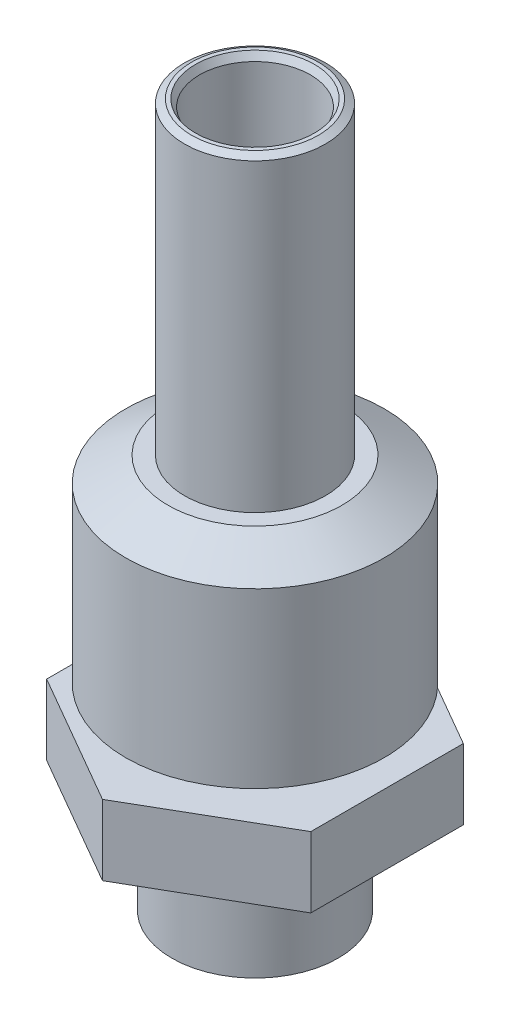
ISO-10303-21;
HEADER;
FILE_DESCRIPTION(('STEP AP214'),'2;1');
FILE_NAME('part.step','',(''),(''),'','','');
FILE_SCHEMA(('AUTOMOTIVE_DESIGN { 1 0 10303 214 1 1 1 1 }'));
ENDSEC;
DATA;
#1=APPLICATION_CONTEXT('core data for automotive mechanical design processes');
#2=APPLICATION_PROTOCOL_DEFINITION('international standard','automotive_design',2000,#1);
#3=PRODUCT_CONTEXT('',#1,'mechanical');
#4=PRODUCT('Part','Part','',(#3));
#5=PRODUCT_RELATED_PRODUCT_CATEGORY('part','',(#4));
#6=PRODUCT_DEFINITION_FORMATION('','',#4);
#7=PRODUCT_DEFINITION_CONTEXT('part definition',#1,'design');
#8=PRODUCT_DEFINITION('design','',#6,#7);
#9=PRODUCT_DEFINITION_SHAPE('','',#8);
#10=(LENGTH_UNIT() NAMED_UNIT(*) SI_UNIT(.MILLI.,.METRE.));
#11=(NAMED_UNIT(*) PLANE_ANGLE_UNIT() SI_UNIT($,.RADIAN.));
#12=(NAMED_UNIT(*) SI_UNIT($,.STERADIAN.) SOLID_ANGLE_UNIT());
#13=UNCERTAINTY_MEASURE_WITH_UNIT(LENGTH_MEASURE(1.E-05),#10,'distance_accuracy_value','');
#14=(GEOMETRIC_REPRESENTATION_CONTEXT(3) GLOBAL_UNCERTAINTY_ASSIGNED_CONTEXT((#13)) GLOBAL_UNIT_ASSIGNED_CONTEXT((#10,
#11,#12)) REPRESENTATION_CONTEXT('',''));
#15=CARTESIAN_POINT('',(0.,0.,0.));
#16=DIRECTION('',(0.,0.,1.));
#17=DIRECTION('',(1.,0.,0.));
#18=AXIS2_PLACEMENT_3D('',#15,#16,#17);
#19=CARTESIAN_POINT('',(4.7625,27.432,2.74963065701559));
#20=DIRECTION('',(-1.,0.,0.));
#21=DIRECTION('',(0.,0.,1.));
#22=AXIS2_PLACEMENT_3D('',#19,#20,#21);
#23=PLANE('',#22);
#24=DIRECTION('',(0.,0.,1.));
#25=VECTOR('',#24,1.);
#26=CARTESIAN_POINT('',(4.7625,5.762,2.74963065701559));
#27=LINE('',#26,#25);
#28=CARTESIAN_POINT('',(4.7625,5.762,-2.74963065701559));
#29=VERTEX_POINT('',#28);
#30=CARTESIAN_POINT('',(4.7625,5.762,2.74963065701559));
#31=VERTEX_POINT('',#30);
#32=EDGE_CURVE('E64',#29,#31,#27,.T.);
#33=ORIENTED_EDGE('',*,*,#32,.F.);
#34=DIRECTION('',(0.,-1.,0.));
#35=VECTOR('',#34,1.);
#36=CARTESIAN_POINT('',(4.7625,27.432,-2.74963065701559));
#37=LINE('',#36,#35);
#38=CARTESIAN_POINT('',(4.7625,8.302,-2.74963065701559));
#39=VERTEX_POINT('',#38);
#40=EDGE_CURVE('E145',#39,#29,#37,.T.);
#41=ORIENTED_EDGE('',*,*,#40,.F.);
#42=DIRECTION('',(0.,0.,1.));
#43=VECTOR('',#42,1.);
#44=CARTESIAN_POINT('',(4.7625,8.302,2.74963065701559));
#45=LINE('',#44,#43);
#46=CARTESIAN_POINT('',(4.7625,8.302,2.74963065701559));
#47=VERTEX_POINT('',#46);
#48=EDGE_CURVE('E134',#39,#47,#45,.T.);
#49=ORIENTED_EDGE('',*,*,#48,.T.);
#50=DIRECTION('',(0.,-1.,0.));
#51=VECTOR('',#50,1.);
#52=CARTESIAN_POINT('',(4.7625,27.432,2.74963065701559));
#53=LINE('',#52,#51);
#54=EDGE_CURVE('E128',#47,#31,#53,.T.);
#55=ORIENTED_EDGE('',*,*,#54,.T.);
#56=EDGE_LOOP('',(#33,#41,#49,#55));
#57=FACE_BOUND('',#56,.T.);
#58=ADVANCED_FACE('F49',(#57),#23,.F.);
#59=CARTESIAN_POINT('',(4.7625,27.432,-2.74963065701559));
#60=DIRECTION('',(-0.5,0.,0.866025403784439));
#61=DIRECTION('',(0.866025403784439,0.,0.5));
#62=AXIS2_PLACEMENT_3D('',#59,#60,#61);
#63=PLANE('',#62);
#64=DIRECTION('',(0.866025403784439,0.,0.5));
#65=VECTOR('',#64,1.);
#66=CARTESIAN_POINT('',(4.76249999999999,5.762,-2.7496306570156));
#67=LINE('',#66,#65);
#68=CARTESIAN_POINT('',(0.,5.762,-5.49926131403118));
#69=VERTEX_POINT('',#68);
#70=EDGE_CURVE('E261',#69,#29,#67,.T.);
#71=ORIENTED_EDGE('',*,*,#70,.F.);
#72=DIRECTION('',(0.,-1.,0.));
#73=VECTOR('',#72,1.);
#74=CARTESIAN_POINT('',(0.,27.432,-5.49926131403118));
#75=LINE('',#74,#73);
#76=CARTESIAN_POINT('',(0.,8.302,-5.49926131403118));
#77=VERTEX_POINT('',#76);
#78=EDGE_CURVE('E141',#77,#69,#75,.T.);
#79=ORIENTED_EDGE('',*,*,#78,.F.);
#80=DIRECTION('',(0.866025403784439,0.,0.5));
#81=VECTOR('',#80,1.);
#82=CARTESIAN_POINT('',(4.7625,8.302,-2.74963065701559));
#83=LINE('',#82,#81);
#84=EDGE_CURVE('E252',#77,#39,#83,.T.);
#85=ORIENTED_EDGE('',*,*,#84,.T.);
#86=ORIENTED_EDGE('',*,*,#40,.T.);
#87=EDGE_LOOP('',(#71,#79,#85,#86));
#88=FACE_BOUND('',#87,.T.);
#89=ADVANCED_FACE('F192',(#88),#63,.F.);
#90=CARTESIAN_POINT('',(0.,27.432,-5.49926131403118));
#91=DIRECTION('',(0.500000000000001,0.,0.866025403784438));
#92=DIRECTION('',(0.866025403784438,0.,-0.500000000000001));
#93=AXIS2_PLACEMENT_3D('',#90,#91,#92);
#94=PLANE('',#93);
#95=DIRECTION('',(0.866025403784438,0.,-0.500000000000001));
#96=VECTOR('',#95,1.);
#97=CARTESIAN_POINT('',(0.,5.762,-5.49926131403118));
#98=LINE('',#97,#96);
#99=CARTESIAN_POINT('',(-4.7625,5.762,-2.74963065701559));
#100=VERTEX_POINT('',#99);
#101=EDGE_CURVE('E265',#100,#69,#98,.T.);
#102=ORIENTED_EDGE('',*,*,#101,.F.);
#103=DIRECTION('',(0.,-1.,0.));
#104=VECTOR('',#103,1.);
#105=CARTESIAN_POINT('',(-4.7625,27.432,-2.74963065701559));
#106=LINE('',#105,#104);
#107=CARTESIAN_POINT('',(-4.7625,8.302,-2.74963065701559));
#108=VERTEX_POINT('',#107);
#109=EDGE_CURVE('E131',#108,#100,#106,.T.);
#110=ORIENTED_EDGE('',*,*,#109,.F.);
#111=DIRECTION('',(0.866025403784438,0.,-0.500000000000001));
#112=VECTOR('',#111,1.);
#113=CARTESIAN_POINT('',(0.,8.302,-5.49926131403118));
#114=LINE('',#113,#112);
#115=EDGE_CURVE('E248',#108,#77,#114,.T.);
#116=ORIENTED_EDGE('',*,*,#115,.T.);
#117=ORIENTED_EDGE('',*,*,#78,.T.);
#118=EDGE_LOOP('',(#102,#110,#116,#117));
#119=FACE_BOUND('',#118,.T.);
#120=ADVANCED_FACE('F198',(#119),#94,.F.);
#121=CARTESIAN_POINT('',(-4.7625,27.432,-2.74963065701559));
#122=DIRECTION('',(1.,0.,0.));
#123=DIRECTION('',(0.,0.,-1.));
#124=AXIS2_PLACEMENT_3D('',#121,#122,#123);
#125=PLANE('',#124);
#126=DIRECTION('',(0.,0.,-1.));
#127=VECTOR('',#126,1.);
#128=CARTESIAN_POINT('',(-4.7625,5.762,-2.74963065701559));
#129=LINE('',#128,#127);
#130=CARTESIAN_POINT('',(-4.7625,5.762,2.7496306570156));
#131=VERTEX_POINT('',#130);
#132=EDGE_CURVE('E122',#131,#100,#129,.T.);
#133=ORIENTED_EDGE('',*,*,#132,.F.);
#134=DIRECTION('',(0.,-1.,0.));
#135=VECTOR('',#134,1.);
#136=CARTESIAN_POINT('',(-4.7625,27.432,2.7496306570156));
#137=LINE('',#136,#135);
#138=CARTESIAN_POINT('',(-4.7625,8.302,2.7496306570156));
#139=VERTEX_POINT('',#138);
#140=EDGE_CURVE('E120',#139,#131,#137,.T.);
#141=ORIENTED_EDGE('',*,*,#140,.F.);
#142=DIRECTION('',(0.,0.,-1.));
#143=VECTOR('',#142,1.);
#144=CARTESIAN_POINT('',(-4.7625,8.302,-2.74963065701559));
#145=LINE('',#144,#143);
#146=EDGE_CURVE('E244',#139,#108,#145,.T.);
#147=ORIENTED_EDGE('',*,*,#146,.T.);
#148=ORIENTED_EDGE('',*,*,#109,.T.);
#149=EDGE_LOOP('',(#133,#141,#147,#148));
#150=FACE_BOUND('',#149,.T.);
#151=ADVANCED_FACE('F267',(#150),#125,.F.);
#152=CARTESIAN_POINT('',(-4.7625,27.432,2.7496306570156));
#153=DIRECTION('',(0.5,0.,-0.866025403784439));
#154=DIRECTION('',(-0.866025403784439,0.,-0.5));
#155=AXIS2_PLACEMENT_3D('',#152,#153,#154);
#156=PLANE('',#155);
#157=DIRECTION('',(-0.866025403784439,0.,-0.5));
#158=VECTOR('',#157,1.);
#159=CARTESIAN_POINT('',(-4.7625,5.762,2.74963065701559));
#160=LINE('',#159,#158);
#161=CARTESIAN_POINT('',(0.,5.762,5.49926131403119));
#162=VERTEX_POINT('',#161);
#163=EDGE_CURVE('E108',#162,#131,#160,.T.);
#164=ORIENTED_EDGE('',*,*,#163,.F.);
#165=DIRECTION('',(0.,-1.,0.));
#166=VECTOR('',#165,1.);
#167=CARTESIAN_POINT('',(0.,27.432,5.49926131403119));
#168=LINE('',#167,#166);
#169=CARTESIAN_POINT('',(0.,8.302,5.49926131403119));
#170=VERTEX_POINT('',#169);
#171=EDGE_CURVE('E118',#170,#162,#168,.T.);
#172=ORIENTED_EDGE('',*,*,#171,.F.);
#173=DIRECTION('',(-0.866025403784439,0.,-0.5));
#174=VECTOR('',#173,1.);
#175=CARTESIAN_POINT('',(-4.7625,8.302,2.7496306570156));
#176=LINE('',#175,#174);
#177=EDGE_CURVE('E72',#170,#139,#176,.T.);
#178=ORIENTED_EDGE('',*,*,#177,.T.);
#179=ORIENTED_EDGE('',*,*,#140,.T.);
#180=EDGE_LOOP('',(#164,#172,#178,#179));
#181=FACE_BOUND('',#180,.T.);
#182=ADVANCED_FACE('F117',(#181),#156,.F.);
#183=CARTESIAN_POINT('',(0.,27.432,5.49926131403119));
#184=DIRECTION('',(-0.5,0.,-0.866025403784438));
#185=DIRECTION('',(-0.866025403784438,0.,0.5));
#186=AXIS2_PLACEMENT_3D('',#183,#184,#185);
#187=PLANE('',#186);
#188=DIRECTION('',(-0.866025403784438,0.,0.5));
#189=VECTOR('',#188,1.);
#190=CARTESIAN_POINT('',(0.,5.762,5.49926131403119));
#191=LINE('',#190,#189);
#192=EDGE_CURVE('E12',#31,#162,#191,.T.);
#193=ORIENTED_EDGE('',*,*,#192,.F.);
#194=ORIENTED_EDGE('',*,*,#54,.F.);
#195=DIRECTION('',(-0.866025403784438,0.,0.5));
#196=VECTOR('',#195,1.);
#197=CARTESIAN_POINT('',(0.,8.302,5.49926131403119));
#198=LINE('',#197,#196);
#199=EDGE_CURVE('E126',#47,#170,#198,.T.);
#200=ORIENTED_EDGE('',*,*,#199,.T.);
#201=ORIENTED_EDGE('',*,*,#171,.T.);
#202=EDGE_LOOP('',(#193,#194,#200,#201));
#203=FACE_BOUND('',#202,.T.);
#204=ADVANCED_FACE('F125',(#203),#187,.F.);
#205=CARTESIAN_POINT('',(0.,1.39107264208463,0.));
#206=DIRECTION('',(0.,1.,0.));
#207=DIRECTION('',(0.,0.,1.));
#208=AXIS2_PLACEMENT_3D('',#205,#206,#207);
#209=CONICAL_SURFACE('',#208,0.,1.08210413623648);
#210=CARTESIAN_POINT('',(0.,1.92116035997955,0.));
#211=DIRECTION('',(0.,-1.,0.));
#212=DIRECTION('',(0.,0.,-1.));
#213=AXIS2_PLACEMENT_3D('',#210,#211,#212);
#214=CIRCLE('',#213,0.996949999999998);
#215=CARTESIAN_POINT('',(0.,1.92116035997955,0.996949999999998));
#216=VERTEX_POINT('',#215);
#217=EDGE_CURVE('E277',#216,#216,#214,.T.);
#218=CARTESIAN_POINT('',(0.,1.524,0.));
#219=DIRECTION('',(0.,-1.,0.));
#220=DIRECTION('',(1.,0.,0.));
#221=AXIS2_PLACEMENT_3D('',#218,#219,#220);
#222=CIRCLE('',#221,0.25);
#223=CARTESIAN_POINT('',(0.,1.524,0.249999999999995));
#224=VERTEX_POINT('',#223);
#225=EDGE_CURVE('E351',#224,#224,#222,.T.);
#226=CARTESIAN_POINT('',(0.,1.92116035997955,0.996949999999998));
#227=CARTESIAN_POINT('',(0.,1.91702327289643,0.989169270833332));
#228=CARTESIAN_POINT('',(0.,1.91288618581331,0.981388541666665));
#229=CARTESIAN_POINT('',(0.,1.90461201164707,0.965827083333331));
#230=CARTESIAN_POINT('',(0.,1.90047492456395,0.958046354166665));
#231=CARTESIAN_POINT('',(0.,1.89220075039771,0.942484895833331));
#232=CARTESIAN_POINT('',(0.,1.88806366331458,0.934704166666665));
#233=CARTESIAN_POINT('',(0.,1.87978948914834,0.919142708333331));
#234=CARTESIAN_POINT('',(0.,1.87565240206522,0.911361979166665));
#235=CARTESIAN_POINT('',(0.,1.86737822789898,0.895800520833331));
#236=CARTESIAN_POINT('',(0.,1.86324114081586,0.888019791666664));
#237=CARTESIAN_POINT('',(0.,1.85496696664962,0.872458333333331));
#238=CARTESIAN_POINT('',(0.,1.8508298795665,0.864677604166664));
#239=CARTESIAN_POINT('',(0.,1.84255570540026,0.849116145833331));
#240=CARTESIAN_POINT('',(0.,1.83841861831714,0.841335416666664));
#241=CARTESIAN_POINT('',(0.,1.8301444441509,0.825773958333331));
#242=CARTESIAN_POINT('',(0.,1.82600735706778,0.817993229166664));
#243=CARTESIAN_POINT('',(0.,1.81773318290154,0.802431770833331));
#244=CARTESIAN_POINT('',(0.,1.81359609581842,0.794651041666664));
#245=CARTESIAN_POINT('',(0.,1.80532192165218,0.779089583333331));
#246=CARTESIAN_POINT('',(0.,1.80118483456906,0.771308854166664));
#247=CARTESIAN_POINT('',(0.,1.79291066040282,0.755747395833331));
#248=CARTESIAN_POINT('',(0.,1.7887735733197,0.747966666666664));
#249=CARTESIAN_POINT('',(0.,1.78049939915346,0.732405208333331));
#250=CARTESIAN_POINT('',(0.,1.77636231207034,0.724624479166664));
#251=CARTESIAN_POINT('',(0.,1.7680881379041,0.70906302083333));
#252=CARTESIAN_POINT('',(0.,1.76395105082098,0.701282291666664));
#253=CARTESIAN_POINT('',(0.,1.75567687665474,0.68572083333333));
#254=CARTESIAN_POINT('',(0.,1.75153978957162,0.677940104166664));
#255=CARTESIAN_POINT('',(0.,1.74326561540537,0.66237864583333));
#256=CARTESIAN_POINT('',(0.,1.73912852832225,0.654597916666664));
#257=CARTESIAN_POINT('',(0.,1.73085435415601,0.63903645833333));
#258=CARTESIAN_POINT('',(0.,1.72671726707289,0.631255729166663));
#259=CARTESIAN_POINT('',(0.,1.71844309290665,0.61569427083333));
#260=CARTESIAN_POINT('',(0.,1.71430600582353,0.607913541666663));
#261=CARTESIAN_POINT('',(0.,1.70603183165729,0.59235208333333));
#262=CARTESIAN_POINT('',(0.,1.70189474457417,0.584571354166663));
#263=CARTESIAN_POINT('',(0.,1.69362057040793,0.56900989583333));
#264=CARTESIAN_POINT('',(0.,1.68948348332481,0.561229166666663));
#265=CARTESIAN_POINT('',(0.,1.68120930915857,0.54566770833333));
#266=CARTESIAN_POINT('',(0.,1.67707222207545,0.537886979166663));
#267=CARTESIAN_POINT('',(0.,1.66879804790921,0.52232552083333));
#268=CARTESIAN_POINT('',(0.,1.66466096082609,0.514544791666663));
#269=CARTESIAN_POINT('',(0.,1.65638678665985,0.49898333333333));
#270=CARTESIAN_POINT('',(0.,1.65224969957673,0.491202604166663));
#271=CARTESIAN_POINT('',(0.,1.64397552541049,0.475641145833329));
#272=CARTESIAN_POINT('',(0.,1.63983843832737,0.467860416666663));
#273=CARTESIAN_POINT('',(0.,1.63156426416113,0.452298958333329));
#274=CARTESIAN_POINT('',(0.,1.62742717707801,0.444518229166663));
#275=CARTESIAN_POINT('',(0.,1.61915300291177,0.428956770833329));
#276=CARTESIAN_POINT('',(0.,1.61501591582865,0.421176041666663));
#277=CARTESIAN_POINT('',(0.,1.60674174166241,0.405614583333329));
#278=CARTESIAN_POINT('',(0.,1.60260465457929,0.397833854166662));
#279=CARTESIAN_POINT('',(0.,1.59433048041304,0.382272395833329));
#280=CARTESIAN_POINT('',(0.,1.59019339332992,0.374491666666662));
#281=CARTESIAN_POINT('',(0.,1.58191921916368,0.358930208333329));
#282=CARTESIAN_POINT('',(0.,1.57778213208056,0.351149479166662));
#283=CARTESIAN_POINT('',(0.,1.56950795791432,0.335588020833329));
#284=CARTESIAN_POINT('',(0.,1.5653708708312,0.327807291666662));
#285=CARTESIAN_POINT('',(0.,1.55709669666496,0.312245833333329));
#286=CARTESIAN_POINT('',(0.,1.55295960958184,0.304465104166662));
#287=CARTESIAN_POINT('',(0.,1.5446854354156,0.288903645833329));
#288=CARTESIAN_POINT('',(0.,1.54054834833248,0.281122916666662));
#289=CARTESIAN_POINT('',(0.,1.53227417416624,0.265561458333329));
#290=CARTESIAN_POINT('',(0.,1.52813708708312,0.257780729166662));
#291=CARTESIAN_POINT('',(0.,1.524,0.249999999999995));
#292=B_SPLINE_CURVE_WITH_KNOTS('',3,(#226,#227,#228,#229,#230,#231,#232,#233,#234,#235,#236,
#237,#238,#239,#240,#241,#242,#243,#244,#245,#246,#247,#248,#249,#250,#251,#252,#253,#254,#255,
#256,#257,#258,#259,#260,#261,#262,#263,#264,#265,#266,#267,#268,#269,#270,#271,#272,#273,#274,
#275,#276,#277,#278,#279,#280,#281,#282,#283,#284,#285,#286,#287,#288,#289,#290,#291),
.UNSPECIFIED.,.F.,.F.,(4,2,2,2,2,2,2,2,2,2,2,2,2,2,2,2,2,2,2,2,2,2,2,2,2,2,2,2,2,2,2,2,4),(0.,
0.0264366624800681,0.0528733249601363,0.0793099874402046,0.105746649920273,0.132183312400341,
0.158619974880409,0.185056637360477,0.211493299840546,0.237929962320614,0.264366624800682,
0.29080328728075,0.317239949760819,0.343676612240887,0.370113274720955,0.396549937201023,
0.422986599681091,0.44942326216116,0.475859924641228,0.502296587121296,0.528733249601364,
0.555169912081433,0.581606574561501,0.608043237041569,0.634479899521637,0.660916562001706,
0.687353224481774,0.713789886961842,0.74022654944191,0.766663211921978,0.793099874402047,
0.819536536882115,0.845973199362183),.UNSPECIFIED.);
#293=EDGE_CURVE('BSEAM307',#216,#224,#292,.T.);
#294=ORIENTED_EDGE('',*,*,#217,.F.);
#295=ORIENTED_EDGE('',*,*,#225,.T.);
#296=ORIENTED_EDGE('',*,*,#293,.T.);
#297=ORIENTED_EDGE('',*,*,#293,.F.);
#298=EDGE_LOOP('',(#294,#296,#295,#297));
#299=FACE_BOUND('',#298,.T.);
#300=ADVANCED_FACE('F307',(#299),#209,.F.);
#301=CARTESIAN_POINT('',(0.,8.302,0.));
#302=DIRECTION('',(0.,-1.,0.));
#303=DIRECTION('',(0.,0.,-1.));
#304=AXIS2_PLACEMENT_3D('',#301,#302,#303);
#305=PLANE('',#304);
#306=CARTESIAN_POINT('',(0.,8.302,0.));
#307=DIRECTION('',(0.,-1.,0.));
#308=DIRECTION('',(0.,0.,-1.));
#309=AXIS2_PLACEMENT_3D('',#306,#307,#308);
#310=CIRCLE('',#309,3.1369);
#311=CARTESIAN_POINT('',(0.,8.302,-3.1369));
#312=VERTEX_POINT('',#311);
#313=EDGE_CURVE('E239',#312,#312,#310,.T.);
#314=ORIENTED_EDGE('',*,*,#313,.T.);
#315=EDGE_LOOP('',(#314));
#316=FACE_BOUND('',#315,.T.);
#317=ORIENTED_EDGE('',*,*,#84,.F.);
#318=ORIENTED_EDGE('',*,*,#115,.F.);
#319=ORIENTED_EDGE('',*,*,#146,.F.);
#320=ORIENTED_EDGE('',*,*,#177,.F.);
#321=ORIENTED_EDGE('',*,*,#199,.F.);
#322=ORIENTED_EDGE('',*,*,#48,.F.);
#323=EDGE_LOOP('',(#317,#318,#319,#320,#321,#322));
#324=FACE_BOUND('',#323,.T.);
#325=ADVANCED_FACE('F258',(#316,#324),#305,.F.);
#326=CARTESIAN_POINT('',(0.,9.181881810245,0.));
#327=DIRECTION('',(0.,1.,0.));
#328=DIRECTION('',(0.,0.,1.));
#329=AXIS2_PLACEMENT_3D('',#326,#327,#328);
#330=CONICAL_SURFACE('',#329,4.6609,1.04719755119659);
#331=ORIENTED_EDGE('',*,*,#313,.F.);
#332=EDGE_LOOP('',(#331));
#333=FACE_BOUND('',#332,.T.);
#334=CARTESIAN_POINT('',(0.,9.181881810245,0.));
#335=DIRECTION('',(0.,-1.,0.));
#336=DIRECTION('',(0.,0.,-1.));
#337=AXIS2_PLACEMENT_3D('',#334,#335,#336);
#338=CIRCLE('',#337,4.6609);
#339=CARTESIAN_POINT('',(0.,9.181881810245,-4.6609));
#340=VERTEX_POINT('',#339);
#341=EDGE_CURVE('E235',#340,#340,#338,.T.);
#342=ORIENTED_EDGE('',*,*,#341,.T.);
#343=EDGE_LOOP('',(#342));
#344=FACE_BOUND('',#343,.T.);
#345=ADVANCED_FACE('F302',(#333,#344),#330,.T.);
#346=CARTESIAN_POINT('',(0.,0.,0.));
#347=DIRECTION('',(0.,-1.,0.));
#348=DIRECTION('',(0.,0.,-1.));
#349=AXIS2_PLACEMENT_3D('',#346,#347,#348);
#350=CYLINDRICAL_SURFACE('',#349,4.6609);
#351=ORIENTED_EDGE('',*,*,#341,.F.);
#352=EDGE_LOOP('',(#351));
#353=FACE_BOUND('',#352,.T.);
#354=CARTESIAN_POINT('',(0.,15.422118189755,0.));
#355=DIRECTION('',(0.,-1.,0.));
#356=DIRECTION('',(0.,0.,-1.));
#357=AXIS2_PLACEMENT_3D('',#354,#355,#356);
#358=CIRCLE('',#357,4.6609);
#359=CARTESIAN_POINT('',(0.,15.422118189755,-4.6609));
#360=VERTEX_POINT('',#359);
#361=EDGE_CURVE('E224',#360,#360,#358,.T.);
#362=ORIENTED_EDGE('',*,*,#361,.T.);
#363=EDGE_LOOP('',(#362));
#364=FACE_BOUND('',#363,.T.);
#365=ADVANCED_FACE('F298',(#353,#364),#350,.T.);
#366=CARTESIAN_POINT('',(0.,16.302,0.));
#367=DIRECTION('',(0.,-1.,0.));
#368=DIRECTION('',(0.,0.,-1.));
#369=AXIS2_PLACEMENT_3D('',#366,#367,#368);
#370=CONICAL_SURFACE('',#369,3.1369,1.0471975511966);
#371=ORIENTED_EDGE('',*,*,#361,.F.);
#372=EDGE_LOOP('',(#371));
#373=FACE_BOUND('',#372,.T.);
#374=CARTESIAN_POINT('',(0.,16.302,0.));
#375=DIRECTION('',(0.,-1.,0.));
#376=DIRECTION('',(0.,0.,-1.));
#377=AXIS2_PLACEMENT_3D('',#374,#375,#376);
#378=CIRCLE('',#377,3.1369);
#379=CARTESIAN_POINT('',(0.,16.302,-3.1369));
#380=VERTEX_POINT('',#379);
#381=EDGE_CURVE('E219',#380,#380,#378,.T.);
#382=ORIENTED_EDGE('',*,*,#381,.T.);
#383=EDGE_LOOP('',(#382));
#384=FACE_BOUND('',#383,.T.);
#385=ADVANCED_FACE('F294',(#373,#384),#370,.T.);
#386=CARTESIAN_POINT('',(0.,16.302,0.));
#387=DIRECTION('',(0.,-1.,0.));
#388=DIRECTION('',(0.,0.,-1.));
#389=AXIS2_PLACEMENT_3D('',#386,#387,#388);
#390=PLANE('',#389);
#391=ORIENTED_EDGE('',*,*,#381,.F.);
#392=EDGE_LOOP('',(#391));
#393=FACE_BOUND('',#392,.T.);
#394=CARTESIAN_POINT('',(0.,16.302,0.));
#395=DIRECTION('',(0.,-1.,0.));
#396=DIRECTION('',(0.,0.,-1.));
#397=AXIS2_PLACEMENT_3D('',#394,#395,#396);
#398=CIRCLE('',#397,2.54);
#399=CARTESIAN_POINT('',(0.,16.302,-2.54));
#400=VERTEX_POINT('',#399);
#401=EDGE_CURVE('E216',#400,#400,#398,.T.);
#402=ORIENTED_EDGE('',*,*,#401,.T.);
#403=EDGE_LOOP('',(#402));
#404=FACE_BOUND('',#403,.T.);
#405=ADVANCED_FACE('F186',(#393,#404),#390,.F.);
#406=CARTESIAN_POINT('',(0.,0.,0.));
#407=DIRECTION('',(0.,-1.,0.));
#408=DIRECTION('',(0.,0.,-1.));
#409=AXIS2_PLACEMENT_3D('',#406,#407,#408);
#410=CYLINDRICAL_SURFACE('',#409,2.54);
#411=CARTESIAN_POINT('',(0.,27.2853530316258,0.));
#412=DIRECTION('',(0.,1.,0.));
#413=DIRECTION('',(0.,0.,1.));
#414=AXIS2_PLACEMENT_3D('',#411,#412,#413);
#415=CIRCLE('',#414,2.54);
#416=CARTESIAN_POINT('',(0.,27.2853530316258,2.54));
#417=VERTEX_POINT('',#416);
#418=EDGE_CURVE('E151',#417,#417,#415,.F.);
#419=ORIENTED_EDGE('',*,*,#418,.T.);
#420=EDGE_LOOP('',(#419));
#421=FACE_BOUND('',#420,.T.);
#422=ORIENTED_EDGE('',*,*,#401,.F.);
#423=EDGE_LOOP('',(#422));
#424=FACE_BOUND('',#423,.T.);
#425=ADVANCED_FACE('F177',(#421,#424),#410,.T.);
#426=CARTESIAN_POINT('',(0.,27.432,0.));
#427=DIRECTION('',(0.,1.,0.));
#428=DIRECTION('',(0.,0.,1.));
#429=AXIS2_PLACEMENT_3D('',#426,#427,#428);
#430=PLANE('',#429);
#431=CARTESIAN_POINT('',(0.,27.432,0.));
#432=DIRECTION('',(0.,1.,0.));
#433=DIRECTION('',(0.,0.,1.));
#434=AXIS2_PLACEMENT_3D('',#431,#432,#433);
#435=CIRCLE('',#434,2.28600000000001);
#436=CARTESIAN_POINT('',(0.,27.432,2.28600000000001));
#437=VERTEX_POINT('',#436);
#438=EDGE_CURVE('E159',#437,#437,#435,.T.);
#439=ORIENTED_EDGE('',*,*,#438,.T.);
#440=EDGE_LOOP('',(#439));
#441=FACE_BOUND('',#440,.T.);
#442=CARTESIAN_POINT('',(0.,27.432,0.));
#443=DIRECTION('',(0.,1.,0.));
#444=DIRECTION('',(0.,0.,1.));
#445=AXIS2_PLACEMENT_3D('',#442,#443,#444);
#446=CIRCLE('',#445,2.14664696837416);
#447=CARTESIAN_POINT('',(0.,27.432,2.14664696837416));
#448=VERTEX_POINT('',#447);
#449=EDGE_CURVE('E155',#448,#448,#446,.F.);
#450=ORIENTED_EDGE('',*,*,#449,.T.);
#451=EDGE_LOOP('',(#450));
#452=FACE_BOUND('',#451,.T.);
#453=ADVANCED_FACE('F175',(#441,#452),#430,.T.);
#454=CARTESIAN_POINT('',(0.,0.,0.));
#455=DIRECTION('',(0.,-1.,0.));
#456=DIRECTION('',(0.,0.,-1.));
#457=AXIS2_PLACEMENT_3D('',#454,#455,#456);
#458=CYLINDRICAL_SURFACE('',#457,2.);
#459=CARTESIAN_POINT('',(0.,27.178,0.));
#460=DIRECTION('',(0.,1.,0.));
#461=DIRECTION('',(0.,0.,1.));
#462=AXIS2_PLACEMENT_3D('',#459,#460,#461);
#463=CIRCLE('',#462,2.);
#464=CARTESIAN_POINT('',(0.,27.178,2.));
#465=VERTEX_POINT('',#464);
#466=EDGE_CURVE('E58',#465,#465,#463,.T.);
#467=ORIENTED_EDGE('',*,*,#466,.T.);
#468=EDGE_LOOP('',(#467));
#469=FACE_BOUND('',#468,.T.);
#470=CARTESIAN_POINT('',(0.,21.082,0.));
#471=DIRECTION('',(0.,-1.,0.));
#472=DIRECTION('',(0.,0.,-1.));
#473=AXIS2_PLACEMENT_3D('',#470,#471,#472);
#474=CIRCLE('',#473,2.);
#475=CARTESIAN_POINT('',(0.,21.082,-2.));
#476=VERTEX_POINT('',#475);
#477=EDGE_CURVE('E220',#476,#476,#474,.T.);
#478=ORIENTED_EDGE('',*,*,#477,.T.);
#479=EDGE_LOOP('',(#478));
#480=FACE_BOUND('',#479,.T.);
#481=ADVANCED_FACE('F167',(#469,#480),#458,.F.);
#482=CARTESIAN_POINT('',(0.,21.082,0.));
#483=DIRECTION('',(0.,1.,0.));
#484=DIRECTION('',(0.,0.,1.));
#485=AXIS2_PLACEMENT_3D('',#482,#483,#484);
#486=PLANE('',#485);
#487=CARTESIAN_POINT('',(0.,21.082,0.));
#488=DIRECTION('',(0.,-1.,0.));
#489=DIRECTION('',(0.,0.,-1.));
#490=AXIS2_PLACEMENT_3D('',#487,#488,#489);
#491=CIRCLE('',#490,0.99695);
#492=CARTESIAN_POINT('',(0.,21.082,-0.99695));
#493=VERTEX_POINT('',#492);
#494=EDGE_CURVE('E228',#493,#493,#491,.T.);
#495=ORIENTED_EDGE('',*,*,#494,.T.);
#496=EDGE_LOOP('',(#495));
#497=FACE_BOUND('',#496,.T.);
#498=ORIENTED_EDGE('',*,*,#477,.F.);
#499=EDGE_LOOP('',(#498));
#500=FACE_BOUND('',#499,.T.);
#501=ADVANCED_FACE('F184',(#497,#500),#486,.T.);
#502=CARTESIAN_POINT('',(0.,0.,0.));
#503=DIRECTION('',(0.,-1.,0.));
#504=DIRECTION('',(0.,0.,-1.));
#505=AXIS2_PLACEMENT_3D('',#502,#503,#504);
#506=CYLINDRICAL_SURFACE('',#505,0.996949999999999);
#507=ORIENTED_EDGE('',*,*,#217,.T.);
#508=EDGE_LOOP('',(#507));
#509=FACE_BOUND('',#508,.T.);
#510=ORIENTED_EDGE('',*,*,#494,.F.);
#511=EDGE_LOOP('',(#510));
#512=FACE_BOUND('',#511,.T.);
#513=ADVANCED_FACE('F203',(#509,#512),#506,.F.);
#514=CARTESIAN_POINT('',(0.,27.2853530316258,0.));
#515=DIRECTION('',(0.,-1.,0.));
#516=DIRECTION('',(0.,0.,-1.));
#517=AXIS2_PLACEMENT_3D('',#514,#515,#516);
#518=CONICAL_SURFACE('',#517,2.54,1.0471975511966);
#519=ORIENTED_EDGE('',*,*,#438,.F.);
#520=EDGE_LOOP('',(#519));
#521=FACE_BOUND('',#520,.T.);
#522=ORIENTED_EDGE('',*,*,#418,.F.);
#523=EDGE_LOOP('',(#522));
#524=FACE_BOUND('',#523,.T.);
#525=ADVANCED_FACE('F172',(#521,#524),#518,.T.);
#526=CARTESIAN_POINT('',(0.,27.432,0.));
#527=DIRECTION('',(0.,1.,0.));
#528=DIRECTION('',(0.,0.,1.));
#529=AXIS2_PLACEMENT_3D('',#526,#527,#528);
#530=CONICAL_SURFACE('',#529,2.14664696837416,0.523598775598291);
#531=ORIENTED_EDGE('',*,*,#466,.F.);
#532=EDGE_LOOP('',(#531));
#533=FACE_BOUND('',#532,.T.);
#534=ORIENTED_EDGE('',*,*,#449,.F.);
#535=EDGE_LOOP('',(#534));
#536=FACE_BOUND('',#535,.T.);
#537=ADVANCED_FACE('F51',(#533,#536),#530,.F.);
#538=CARTESIAN_POINT('',(-3.,5.762,0.));
#539=DIRECTION('',(0.,-1.,0.));
#540=DIRECTION('',(1.,0.,0.));
#541=AXIS2_PLACEMENT_3D('',#538,#539,#540);
#542=PLANE('',#541);
#543=CARTESIAN_POINT('',(0.,5.762,0.));
#544=DIRECTION('',(0.,-1.,0.));
#545=DIRECTION('',(1.,0.,0.));
#546=AXIS2_PLACEMENT_3D('',#543,#544,#545);
#547=CIRCLE('',#546,3.);
#548=CARTESIAN_POINT('',(3.,5.762,0.));
#549=VERTEX_POINT('',#548);
#550=EDGE_CURVE('E348',#549,#549,#547,.T.);
#551=ORIENTED_EDGE('',*,*,#550,.F.);
#552=EDGE_LOOP('',(#551));
#553=FACE_BOUND('',#552,.T.);
#554=ORIENTED_EDGE('',*,*,#32,.T.);
#555=ORIENTED_EDGE('',*,*,#192,.T.);
#556=ORIENTED_EDGE('',*,*,#163,.T.);
#557=ORIENTED_EDGE('',*,*,#132,.T.);
#558=ORIENTED_EDGE('',*,*,#101,.T.);
#559=ORIENTED_EDGE('',*,*,#70,.T.);
#560=EDGE_LOOP('',(#554,#555,#556,#557,#558,#559));
#561=FACE_BOUND('',#560,.T.);
#562=ADVANCED_FACE('F107',(#553,#561),#542,.T.);
#563=CARTESIAN_POINT('',(0.,0.,0.));
#564=DIRECTION('',(0.,-1.,0.));
#565=DIRECTION('',(1.,0.,0.));
#566=AXIS2_PLACEMENT_3D('',#563,#564,#565);
#567=CYLINDRICAL_SURFACE('',#566,0.25);
#568=CARTESIAN_POINT('',(0.,0.762,0.));
#569=DIRECTION('',(0.,-1.,0.));
#570=DIRECTION('',(1.,0.,0.));
#571=AXIS2_PLACEMENT_3D('',#568,#569,#570);
#572=CIRCLE('',#571,0.25);
#573=CARTESIAN_POINT('',(0.25,0.762,0.));
#574=VERTEX_POINT('',#573);
#575=EDGE_CURVE('E123',#574,#574,#572,.T.);
#576=ORIENTED_EDGE('',*,*,#575,.T.);
#577=EDGE_LOOP('',(#576));
#578=FACE_BOUND('',#577,.T.);
#579=ORIENTED_EDGE('',*,*,#225,.F.);
#580=EDGE_LOOP('',(#579));
#581=FACE_BOUND('',#580,.T.);
#582=ADVANCED_FACE('F326',(#578,#581),#567,.F.);
#583=CARTESIAN_POINT('',(-0.25,0.762,0.));
#584=DIRECTION('',(0.,-1.,0.));
#585=DIRECTION('',(1.,0.,0.));
#586=AXIS2_PLACEMENT_3D('',#583,#584,#585);
#587=PLANE('',#586);
#588=CARTESIAN_POINT('',(0.,0.762,0.));
#589=DIRECTION('',(0.,-1.,0.));
#590=DIRECTION('',(1.,0.,0.));
#591=AXIS2_PLACEMENT_3D('',#588,#589,#590);
#592=CIRCLE('',#591,0.5);
#593=CARTESIAN_POINT('',(-0.5,0.762,0.));
#594=VERTEX_POINT('',#593);
#595=EDGE_CURVE('E355',#594,#594,#592,.T.);
#596=ORIENTED_EDGE('',*,*,#595,.T.);
#597=EDGE_LOOP('',(#596));
#598=FACE_BOUND('',#597,.T.);
#599=ORIENTED_EDGE('',*,*,#575,.F.);
#600=EDGE_LOOP('',(#599));
#601=FACE_BOUND('',#600,.T.);
#602=ADVANCED_FACE('F329',(#598,#601),#587,.T.);
#603=CARTESIAN_POINT('',(0.,0.762,0.));
#604=DIRECTION('',(0.,1.,0.));
#605=DIRECTION('',(-1.,0.,0.));
#606=AXIS2_PLACEMENT_3D('',#603,#604,#605);
#607=CONICAL_SURFACE('',#606,0.5,1.08210413623643);
#608=CARTESIAN_POINT('',(0.,2.09127357915389,0.));
#609=DIRECTION('',(0.,-1.,0.));
#610=DIRECTION('',(1.,0.,0.));
#611=AXIS2_PLACEMENT_3D('',#608,#609,#610);
#612=CIRCLE('',#611,3.);
#613=CARTESIAN_POINT('',(-3.,2.09127357915389,0.));
#614=VERTEX_POINT('',#613);
#615=EDGE_CURVE('E350',#614,#614,#612,.T.);
#616=CARTESIAN_POINT('',(-3.,2.09127357915389,0.));
#617=CARTESIAN_POINT('',(-2.97395833333333,2.07742697937103,0.));
#618=CARTESIAN_POINT('',(-2.94791666666667,2.06358037958818,0.));
#619=CARTESIAN_POINT('',(-2.89583333333333,2.03588718002247,0.));
#620=CARTESIAN_POINT('',(-2.86979166666667,2.02204058023962,0.));
#621=CARTESIAN_POINT('',(-2.81770833333333,1.99434738067392,0.));
#622=CARTESIAN_POINT('',(-2.79166666666667,1.98050078089106,0.));
#623=CARTESIAN_POINT('',(-2.73958333333333,1.95280758132536,0.));
#624=CARTESIAN_POINT('',(-2.71354166666667,1.9389609815425,0.));
#625=CARTESIAN_POINT('',(-2.66145833333333,1.9112677819768,0.));
#626=CARTESIAN_POINT('',(-2.63541666666667,1.89742118219394,0.));
#627=CARTESIAN_POINT('',(-2.58333333333333,1.86972798262824,0.));
#628=CARTESIAN_POINT('',(-2.55729166666667,1.85588138284539,0.));
#629=CARTESIAN_POINT('',(-2.50520833333333,1.82818818327968,0.));
#630=CARTESIAN_POINT('',(-2.47916666666667,1.81434158349683,0.));
#631=CARTESIAN_POINT('',(-2.42708333333333,1.78664838393112,0.));
#632=CARTESIAN_POINT('',(-2.40104166666667,1.77280178414827,0.));
#633=CARTESIAN_POINT('',(-2.34895833333333,1.74510858458256,0.));
#634=CARTESIAN_POINT('',(-2.32291666666667,1.73126198479971,0.));
#635=CARTESIAN_POINT('',(-2.27083333333333,1.703568785234,0.));
#636=CARTESIAN_POINT('',(-2.24479166666667,1.68972218545115,0.));
#637=CARTESIAN_POINT('',(-2.19270833333333,1.66202898588544,0.));
#638=CARTESIAN_POINT('',(-2.16666666666667,1.64818238610259,0.));
#639=CARTESIAN_POINT('',(-2.11458333333333,1.62048918653688,0.));
#640=CARTESIAN_POINT('',(-2.08854166666667,1.60664258675403,0.));
#641=CARTESIAN_POINT('',(-2.03645833333333,1.57894938718833,0.));
#642=CARTESIAN_POINT('',(-2.01041666666667,1.56510278740547,0.));
#643=CARTESIAN_POINT('',(-1.95833333333333,1.53740958783977,0.));
#644=CARTESIAN_POINT('',(-1.93229166666667,1.52356298805691,0.));
#645=CARTESIAN_POINT('',(-1.88020833333333,1.49586978849121,0.));
#646=CARTESIAN_POINT('',(-1.85416666666667,1.48202318870836,0.));
#647=CARTESIAN_POINT('',(-1.80208333333333,1.45432998914265,0.));
#648=CARTESIAN_POINT('',(-1.77604166666667,1.4404833893598,0.));
#649=CARTESIAN_POINT('',(-1.72395833333333,1.41279018979409,0.));
#650=CARTESIAN_POINT('',(-1.69791666666667,1.39894359001124,0.));
#651=CARTESIAN_POINT('',(-1.64583333333333,1.37125039044553,0.));
#652=CARTESIAN_POINT('',(-1.61979166666667,1.35740379066268,0.));
#653=CARTESIAN_POINT('',(-1.56770833333333,1.32971059109697,0.));
#654=CARTESIAN_POINT('',(-1.54166666666667,1.31586399131412,0.));
#655=CARTESIAN_POINT('',(-1.48958333333333,1.28817079174841,0.));
#656=CARTESIAN_POINT('',(-1.46354166666667,1.27432419196556,0.));
#657=CARTESIAN_POINT('',(-1.41145833333333,1.24663099239985,0.));
#658=CARTESIAN_POINT('',(-1.38541666666667,1.232784392617,0.));
#659=CARTESIAN_POINT('',(-1.33333333333333,1.2050911930513,0.));
#660=CARTESIAN_POINT('',(-1.30729166666667,1.19124459326844,0.));
#661=CARTESIAN_POINT('',(-1.25520833333333,1.16355139370274,0.));
#662=CARTESIAN_POINT('',(-1.22916666666667,1.14970479391988,0.));
#663=CARTESIAN_POINT('',(-1.17708333333333,1.12201159435418,0.));
#664=CARTESIAN_POINT('',(-1.15104166666667,1.10816499457132,0.));
#665=CARTESIAN_POINT('',(-1.09895833333333,1.08047179500562,0.));
#666=CARTESIAN_POINT('',(-1.07291666666667,1.06662519522277,0.));
#667=CARTESIAN_POINT('',(-1.02083333333333,1.03893199565706,0.));
#668=CARTESIAN_POINT('',(-0.994791666666667,1.02508539587421,0.));
#669=CARTESIAN_POINT('',(-0.942708333333333,0.9973921963085,0.));
#670=CARTESIAN_POINT('',(-0.916666666666667,0.983545596525648,0.));
#671=CARTESIAN_POINT('',(-0.864583333333333,0.955852396959942,0.));
#672=CARTESIAN_POINT('',(-0.838541666666667,0.942005797177089,0.));
#673=CARTESIAN_POINT('',(-0.786458333333333,0.914312597611383,0.));
#674=CARTESIAN_POINT('',(-0.760416666666667,0.90046599782853,0.));
#675=CARTESIAN_POINT('',(-0.708333333333333,0.872772798262824,0.));
#676=CARTESIAN_POINT('',(-0.682291666666667,0.858926198479971,0.));
#677=CARTESIAN_POINT('',(-0.630208333333333,0.831232998914265,0.));
#678=CARTESIAN_POINT('',(-0.604166666666667,0.817386399131412,0.));
#679=CARTESIAN_POINT('',(-0.552083333333333,0.789693199565706,0.));
#680=CARTESIAN_POINT('',(-0.526041666666667,0.775846599782853,0.));
#681=CARTESIAN_POINT('',(-0.5,0.762,0.));
#682=B_SPLINE_CURVE_WITH_KNOTS('',3,(#616,#617,#618,#619,#620,#621,#622,#623,#624,#625,#626,
#627,#628,#629,#630,#631,#632,#633,#634,#635,#636,#637,#638,#639,#640,#641,#642,#643,#644,#645,
#646,#647,#648,#649,#650,#651,#652,#653,#654,#655,#656,#657,#658,#659,#660,#661,#662,#663,#664,
#665,#666,#667,#668,#669,#670,#671,#672,#673,#674,#675,#676,#677,#678,#679,#680,#681),
.UNSPECIFIED.,.F.,.F.,(4,2,2,2,2,2,2,2,2,2,2,2,2,2,2,2,2,2,2,2,2,2,2,2,2,2,2,2,2,2,2,2,4),(0.,
0.0884820352100836,0.176964070420168,0.265446105630252,0.353928140840336,0.44241017605042,
0.530892211260503,0.619374246470587,0.707856281680671,0.796338316890755,0.884820352100839,
0.973302387310923,1.06178442252101,1.15026645773109,1.23874849294117,1.32723052815126,
1.41571256336134,1.50419459857143,1.59267663378151,1.68115866899159,1.76964070420168,
1.85812273941176,1.94660477462185,2.03508680983193,2.12356884504201,2.2120508802521,
2.30053291546218,2.38901495067227,2.47749698588235,2.56597902109243,2.65446105630252,
2.7429430915126,2.83142512672269),.UNSPECIFIED.);
#683=EDGE_CURVE('BSEAM333',#614,#594,#682,.T.);
#684=ORIENTED_EDGE('',*,*,#615,.T.);
#685=ORIENTED_EDGE('',*,*,#595,.F.);
#686=ORIENTED_EDGE('',*,*,#683,.T.);
#687=ORIENTED_EDGE('',*,*,#683,.F.);
#688=EDGE_LOOP('',(#684,#686,#685,#687));
#689=FACE_BOUND('',#688,.T.);
#690=ADVANCED_FACE('F333',(#689),#607,.T.);
#691=CARTESIAN_POINT('',(0.,0.,0.));
#692=DIRECTION('',(0.,-1.,0.));
#693=DIRECTION('',(1.,0.,0.));
#694=AXIS2_PLACEMENT_3D('',#691,#692,#693);
#695=CYLINDRICAL_SURFACE('',#694,3.);
#696=ORIENTED_EDGE('',*,*,#550,.T.);
#697=EDGE_LOOP('',(#696));
#698=FACE_BOUND('',#697,.T.);
#699=ORIENTED_EDGE('',*,*,#615,.F.);
#700=EDGE_LOOP('',(#699));
#701=FACE_BOUND('',#700,.T.);
#702=ADVANCED_FACE('F337',(#698,#701),#695,.T.);
#703=CLOSED_SHELL('',(#58,#89,#120,#151,#182,#204,#300,#325,#345,#365,#385,#405,#425,#453,#481,
#501,#513,#525,#537,#562,#582,#602,#690,#702));
#704=MANIFOLD_SOLID_BREP('B2',#703);
#705=ADVANCED_BREP_SHAPE_REPRESENTATION('',(#18,#704),#14);
#706=SHAPE_DEFINITION_REPRESENTATION(#9,#705);
ENDSEC;
END-ISO-10303-21;
